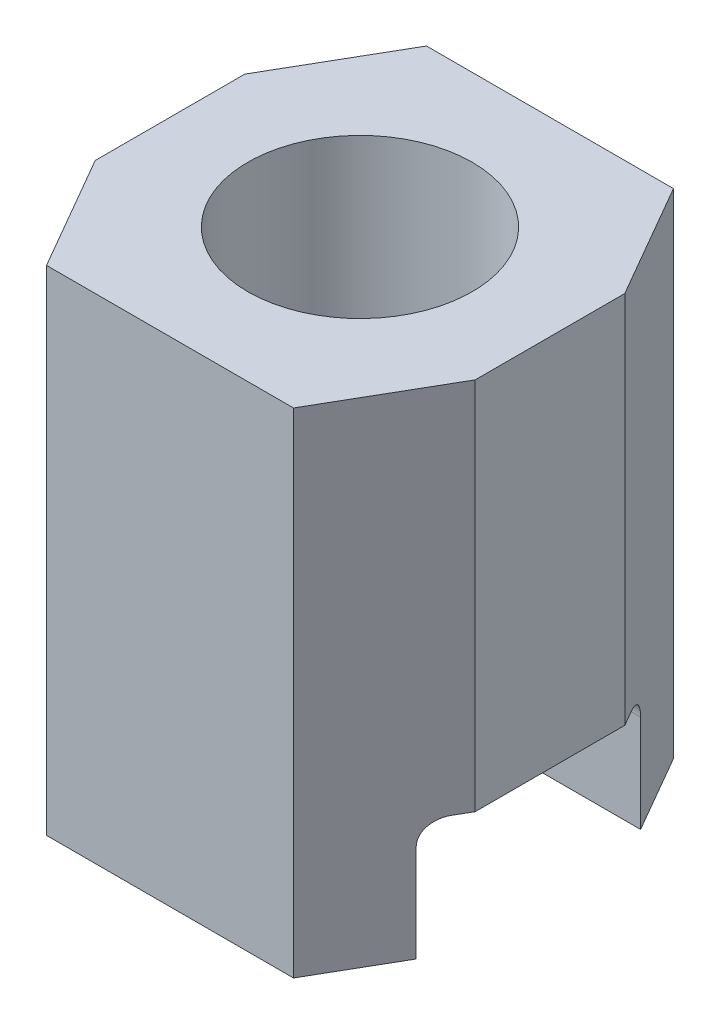
ISO-10303-21;
HEADER;
FILE_DESCRIPTION(('STEP AP214'),'2;1');
FILE_NAME('part.step','',(''),(''),'','','');
FILE_SCHEMA(('AUTOMOTIVE_DESIGN { 1 0 10303 214 1 1 1 1 }'));
ENDSEC;
DATA;
#1=APPLICATION_CONTEXT('core data for automotive mechanical design processes');
#2=APPLICATION_PROTOCOL_DEFINITION('international standard','automotive_design',2000,#1);
#3=PRODUCT_CONTEXT('',#1,'mechanical');
#4=PRODUCT('Part','Part','',(#3));
#5=PRODUCT_RELATED_PRODUCT_CATEGORY('part','',(#4));
#6=PRODUCT_DEFINITION_FORMATION('','',#4);
#7=PRODUCT_DEFINITION_CONTEXT('part definition',#1,'design');
#8=PRODUCT_DEFINITION('design','',#6,#7);
#9=PRODUCT_DEFINITION_SHAPE('','',#8);
#10=(LENGTH_UNIT() NAMED_UNIT(*) SI_UNIT(.MILLI.,.METRE.));
#11=(NAMED_UNIT(*) PLANE_ANGLE_UNIT() SI_UNIT($,.RADIAN.));
#12=(NAMED_UNIT(*) SI_UNIT($,.STERADIAN.) SOLID_ANGLE_UNIT());
#13=UNCERTAINTY_MEASURE_WITH_UNIT(LENGTH_MEASURE(1.E-05),#10,'distance_accuracy_value','');
#14=(GEOMETRIC_REPRESENTATION_CONTEXT(3) GLOBAL_UNCERTAINTY_ASSIGNED_CONTEXT((#13)) GLOBAL_UNIT_ASSIGNED_CONTEXT((#10,
#11,#12)) REPRESENTATION_CONTEXT('',''));
#15=CARTESIAN_POINT('',(0.,0.,0.));
#16=DIRECTION('',(0.,0.,1.));
#17=DIRECTION('',(1.,0.,0.));
#18=AXIS2_PLACEMENT_3D('',#15,#16,#17);
#19=CARTESIAN_POINT('',(0.,3.3,0.));
#20=DIRECTION('',(0.,-1.,0.));
#21=DIRECTION('',(0.,0.,-1.));
#22=AXIS2_PLACEMENT_3D('',#19,#20,#21);
#23=CYLINDRICAL_SURFACE('',#22,0.675);
#24=CARTESIAN_POINT('',(-0.309232921921328,0.8,-0.599999999999999));
#25=CARTESIAN_POINT('',(-0.293758565389485,0.799987558335421,-0.607974719059376));
#26=CARTESIAN_POINT('',(-0.278007555192805,0.799367106120461,-0.6153353967344));
#27=CARTESIAN_POINT('',(-0.24604250612503,0.797368657127726,-0.628799456506238));
#28=CARTESIAN_POINT('',(-0.229829051483721,0.795991579256473,-0.634904351389737));
#29=CARTESIAN_POINT('',(-0.180656010382408,0.791416118461383,-0.651290683062896));
#30=CARTESIAN_POINT('',(-0.147084684163077,0.787768815515238,-0.659684327113981));
#31=CARTESIAN_POINT('',(-0.0952185563023754,0.783488583059046,-0.668494789506155));
#32=CARTESIAN_POINT('',(-0.0772740178003726,0.782247628946401,-0.670806758580366));
#33=CARTESIAN_POINT('',(-0.0412245284595988,0.780499542711605,-0.673982479585743));
#34=CARTESIAN_POINT('',(-0.0231196776247754,0.779991981640827,-0.674847078105324));
#35=CARTESIAN_POINT('',(0.0131083447096233,0.779837068245208,-0.675115800353034));
#36=CARTESIAN_POINT('',(0.0312315190272777,0.780189878682696,-0.674519647740835));
#37=CARTESIAN_POINT('',(0.0673378419471818,0.781665054969914,-0.671877055072463));
#38=CARTESIAN_POINT('',(0.085320947870717,0.782787646755871,-0.669830189215849));
#39=CARTESIAN_POINT('',(0.138950825568206,0.786943014713233,-0.661533601460079));
#40=CARTESIAN_POINT('',(0.174228798175258,0.790762474303631,-0.653127610667915));
#41=CARTESIAN_POINT('',(0.225877955633943,0.795645534336564,-0.636344312659647));
#42=CARTESIAN_POINT('',(0.242912566135772,0.797134112618575,-0.630039021519494));
#43=CARTESIAN_POINT('',(0.276476574402827,0.799304597594941,-0.616048824535539));
#44=CARTESIAN_POINT('',(0.293005389520438,0.799985605747464,-0.608362392892528));
#45=CARTESIAN_POINT('',(0.309232921921326,0.800000000000028,-0.600000000000001));
#46=B_SPLINE_CURVE_WITH_KNOTS('',3,(#24,#25,#26,#27,#28,#29,#30,#31,#32,#33,#34,#35,#36,#37,#38,
#39,#40,#41,#42,#43,#44,#45),.UNSPECIFIED.,.F.,.F.,(4,2,2,2,2,2,2,2,2,2,4),(0.,
0.0521470728682404,0.104230953713443,0.208134724628482,0.262484368425788,0.31680221119194,
0.371130330430986,0.425474402183298,0.53430871682001,0.588922922230222,0.643597837217738),.UNSPECIFIED.);
#47=CARTESIAN_POINT('',(-0.309232921921328,0.8,-0.599999999999999));
#48=VERTEX_POINT('',#47);
#49=CARTESIAN_POINT('',(0.309232921921327,0.8,-0.599999999999999));
#50=VERTEX_POINT('',#49);
#51=EDGE_CURVE('E294',#48,#50,#46,.T.);
#52=ORIENTED_EDGE('',*,*,#51,.T.);
#53=CARTESIAN_POINT('',(0.,0.8,0.));
#54=DIRECTION('',(0.,1.,0.));
#55=DIRECTION('',(0.,0.,1.));
#56=AXIS2_PLACEMENT_3D('',#53,#54,#55);
#57=CIRCLE('',#56,0.675);
#58=CARTESIAN_POINT('',(0.309232921921327,0.8,0.599999999999999));
#59=VERTEX_POINT('',#58);
#60=EDGE_CURVE('E280',#50,#59,#57,.F.);
#61=ORIENTED_EDGE('',*,*,#60,.T.);
#62=CARTESIAN_POINT('',(0.309232921921327,0.8,0.599999999999999));
#63=CARTESIAN_POINT('',(0.293758565389485,0.799987558335421,0.607974719059377));
#64=CARTESIAN_POINT('',(0.278007555192805,0.799367106120461,0.6153353967344));
#65=CARTESIAN_POINT('',(0.246042506125029,0.797368657127726,0.628799456506239));
#66=CARTESIAN_POINT('',(0.22982905148372,0.795991579256473,0.634904351389737));
#67=CARTESIAN_POINT('',(0.180656010382407,0.791416118461383,0.651290683062897));
#68=CARTESIAN_POINT('',(0.147084684163076,0.787768815515237,0.659684327113981));
#69=CARTESIAN_POINT('',(0.0952185563023738,0.783488583059046,0.668494789506155));
#70=CARTESIAN_POINT('',(0.0772740178003709,0.782247628946401,0.670806758580366));
#71=CARTESIAN_POINT('',(0.0412245284595968,0.780499542711605,0.673982479585743));
#72=CARTESIAN_POINT('',(0.0231196776247733,0.779991981640827,0.674847078105324));
#73=CARTESIAN_POINT('',(-0.0131083447096256,0.779837068245208,0.675115800353034));
#74=CARTESIAN_POINT('',(-0.0312315190272802,0.780189878682696,0.674519647740835));
#75=CARTESIAN_POINT('',(-0.0673378419471845,0.781665054969915,0.671877055072463));
#76=CARTESIAN_POINT('',(-0.0853209478707198,0.782787646755871,0.669830189215848));
#77=CARTESIAN_POINT('',(-0.138950825568208,0.786943014713233,0.661533601460079));
#78=CARTESIAN_POINT('',(-0.17422879817526,0.790762474303631,0.653127610667915));
#79=CARTESIAN_POINT('',(-0.225877955633943,0.795645534336564,0.636344312659646));
#80=CARTESIAN_POINT('',(-0.242912566135772,0.797134112618575,0.630039021519494));
#81=CARTESIAN_POINT('',(-0.276476574402826,0.799304597594941,0.61604882453554));
#82=CARTESIAN_POINT('',(-0.293005389520437,0.799985605747464,0.608362392892528));
#83=CARTESIAN_POINT('',(-0.309232921921324,0.800000000000028,0.600000000000002));
#84=B_SPLINE_CURVE_WITH_KNOTS('',3,(#62,#63,#64,#65,#66,#67,#68,#69,#70,#71,#72,#73,#74,#75,#76,
#77,#78,#79,#80,#81,#82,#83),.UNSPECIFIED.,.F.,.F.,(4,2,2,2,2,2,2,2,2,2,4),(0.,
0.0521470728682406,0.104230953713444,0.208134724628483,0.262484368425789,0.316802211191941,
0.371130330430988,0.425474402183301,0.53430871682001,0.588922922230221,0.643597837217735),.UNSPECIFIED.);
#85=CARTESIAN_POINT('',(-0.309232921921327,0.8,0.599999999999999));
#86=VERTEX_POINT('',#85);
#87=EDGE_CURVE('E272',#59,#86,#84,.T.);
#88=ORIENTED_EDGE('',*,*,#87,.T.);
#89=EDGE_CURVE('E301',#86,#48,#57,.F.);
#90=ORIENTED_EDGE('',*,*,#89,.T.);
#91=EDGE_LOOP('',(#52,#61,#88,#90));
#92=FACE_BOUND('',#91,.T.);
#93=CARTESIAN_POINT('',(0.,1.3,0.));
#94=DIRECTION('',(0.,1.,0.));
#95=DIRECTION('',(0.,0.,1.));
#96=AXIS2_PLACEMENT_3D('',#93,#94,#95);
#97=CIRCLE('',#96,0.675);
#98=CARTESIAN_POINT('',(0.,1.3,0.675));
#99=VERTEX_POINT('',#98);
#100=EDGE_CURVE('E37',#99,#99,#97,.T.);
#101=ORIENTED_EDGE('',*,*,#100,.T.);
#102=EDGE_LOOP('',(#101));
#103=FACE_BOUND('',#102,.T.);
#104=ADVANCED_FACE('F33',(#92,#103),#23,.F.);
#105=CARTESIAN_POINT('',(0.,0.,0.));
#106=DIRECTION('',(0.,-1.,0.));
#107=DIRECTION('',(0.,0.,-1.));
#108=AXIS2_PLACEMENT_3D('',#105,#106,#107);
#109=PLANE('',#108);
#110=DIRECTION('',(-1.,0.,0.));
#111=VECTOR('',#110,1.);
#112=CARTESIAN_POINT('',(1.271,0.,-0.75));
#113=LINE('',#112,#111);
#114=CARTESIAN_POINT('',(1.12566243270259,0.,-0.75));
#115=VERTEX_POINT('',#114);
#116=CARTESIAN_POINT('',(-1.1256624327026,0.,-0.75));
#117=VERTEX_POINT('',#116);
#118=EDGE_CURVE('E159',#115,#117,#113,.T.);
#119=ORIENTED_EDGE('',*,*,#118,.T.);
#120=DIRECTION('',(-0.499999999999998,0.,0.86602540378444));
#121=VECTOR('',#120,1.);
#122=CARTESIAN_POINT('',(-1.27,0.,-0.5));
#123=LINE('',#122,#121);
#124=CARTESIAN_POINT('',(-0.825440292723991,0.,-1.27));
#125=VERTEX_POINT('',#124);
#126=EDGE_CURVE('E174',#125,#117,#123,.T.);
#127=ORIENTED_EDGE('',*,*,#126,.F.);
#128=DIRECTION('',(-1.,0.,0.));
#129=VECTOR('',#128,1.);
#130=CARTESIAN_POINT('',(-0.825440292723991,0.,-1.27));
#131=LINE('',#130,#129);
#132=CARTESIAN_POINT('',(0.825440292723991,0.,-1.27));
#133=VERTEX_POINT('',#132);
#134=EDGE_CURVE('E186',#133,#125,#131,.T.);
#135=ORIENTED_EDGE('',*,*,#134,.F.);
#136=DIRECTION('',(-0.499999999999997,0.,-0.86602540378444));
#137=VECTOR('',#136,1.);
#138=CARTESIAN_POINT('',(0.825440292723991,0.,-1.27));
#139=LINE('',#138,#137);
#140=EDGE_CURVE('E184',#115,#133,#139,.T.);
#141=ORIENTED_EDGE('',*,*,#140,.F.);
#142=EDGE_LOOP('',(#119,#127,#135,#141));
#143=FACE_BOUND('',#142,.T.);
#144=ADVANCED_FACE('F332',(#143),#109,.T.);
#145=CARTESIAN_POINT('',(0.,3.3,0.));
#146=DIRECTION('',(0.,-1.,0.));
#147=DIRECTION('',(0.,0.,-1.));
#148=AXIS2_PLACEMENT_3D('',#145,#146,#147);
#149=PLANE('',#148);
#150=CARTESIAN_POINT('',(0.,3.3,0.));
#151=DIRECTION('',(0.,1.,0.));
#152=DIRECTION('',(0.,0.,1.));
#153=AXIS2_PLACEMENT_3D('',#150,#151,#152);
#154=CIRCLE('',#153,0.75);
#155=CARTESIAN_POINT('',(0.,3.3,0.75));
#156=VERTEX_POINT('',#155);
#157=EDGE_CURVE('E485',#156,#156,#154,.T.);
#158=ORIENTED_EDGE('',*,*,#157,.F.);
#159=EDGE_LOOP('',(#158));
#160=FACE_BOUND('',#159,.T.);
#161=DIRECTION('',(-0.499999999999998,0.,0.86602540378444));
#162=VECTOR('',#161,1.);
#163=CARTESIAN_POINT('',(-1.27,3.3,-0.5));
#164=LINE('',#163,#162);
#165=CARTESIAN_POINT('',(-0.825440292723991,3.3,-1.27));
#166=VERTEX_POINT('',#165);
#167=CARTESIAN_POINT('',(-1.27,3.3,-0.5));
#168=VERTEX_POINT('',#167);
#169=EDGE_CURVE('E188',#166,#168,#164,.T.);
#170=ORIENTED_EDGE('',*,*,#169,.T.);
#171=DIRECTION('',(0.,0.,1.));
#172=VECTOR('',#171,1.);
#173=CARTESIAN_POINT('',(-1.27,3.3,0.5));
#174=LINE('',#173,#172);
#175=CARTESIAN_POINT('',(-1.27,3.3,0.5));
#176=VERTEX_POINT('',#175);
#177=EDGE_CURVE('E214',#168,#176,#174,.T.);
#178=ORIENTED_EDGE('',*,*,#177,.T.);
#179=DIRECTION('',(0.499999999999998,0.,0.86602540378444));
#180=VECTOR('',#179,1.);
#181=CARTESIAN_POINT('',(-0.825440292723991,3.3,1.27));
#182=LINE('',#181,#180);
#183=CARTESIAN_POINT('',(-0.825440292723991,3.3,1.27));
#184=VERTEX_POINT('',#183);
#185=EDGE_CURVE('E210',#176,#184,#182,.T.);
#186=ORIENTED_EDGE('',*,*,#185,.T.);
#187=DIRECTION('',(1.,0.,0.));
#188=VECTOR('',#187,1.);
#189=CARTESIAN_POINT('',(0.825440292723991,3.3,1.27));
#190=LINE('',#189,#188);
#191=CARTESIAN_POINT('',(0.825440292723991,3.3,1.27));
#192=VERTEX_POINT('',#191);
#193=EDGE_CURVE('E241',#184,#192,#190,.T.);
#194=ORIENTED_EDGE('',*,*,#193,.T.);
#195=DIRECTION('',(0.499999999999997,0.,-0.86602540378444));
#196=VECTOR('',#195,1.);
#197=CARTESIAN_POINT('',(1.27,3.3,0.5));
#198=LINE('',#197,#196);
#199=CARTESIAN_POINT('',(1.27,3.3,0.5));
#200=VERTEX_POINT('',#199);
#201=EDGE_CURVE('E243',#192,#200,#198,.T.);
#202=ORIENTED_EDGE('',*,*,#201,.T.);
#203=DIRECTION('',(0.,0.,-1.));
#204=VECTOR('',#203,1.);
#205=CARTESIAN_POINT('',(1.27,3.3,-0.5));
#206=LINE('',#205,#204);
#207=CARTESIAN_POINT('',(1.27,3.3,-0.5));
#208=VERTEX_POINT('',#207);
#209=EDGE_CURVE('E245',#200,#208,#206,.T.);
#210=ORIENTED_EDGE('',*,*,#209,.T.);
#211=DIRECTION('',(-0.499999999999997,0.,-0.86602540378444));
#212=VECTOR('',#211,1.);
#213=CARTESIAN_POINT('',(0.825440292723991,3.3,-1.27));
#214=LINE('',#213,#212);
#215=CARTESIAN_POINT('',(0.825440292723991,3.3,-1.27));
#216=VERTEX_POINT('',#215);
#217=EDGE_CURVE('E247',#208,#216,#214,.T.);
#218=ORIENTED_EDGE('',*,*,#217,.T.);
#219=DIRECTION('',(-1.,0.,0.));
#220=VECTOR('',#219,1.);
#221=CARTESIAN_POINT('',(-0.825440292723991,3.3,-1.27));
#222=LINE('',#221,#220);
#223=EDGE_CURVE('E193',#216,#166,#222,.T.);
#224=ORIENTED_EDGE('',*,*,#223,.T.);
#225=EDGE_LOOP('',(#170,#178,#186,#194,#202,#210,#218,#224));
#226=FACE_BOUND('',#225,.T.);
#227=ADVANCED_FACE('F251',(#160,#226),#149,.F.);
#228=DIRECTION('',(-1.,0.,0.));
#229=VECTOR('',#228,1.);
#230=CARTESIAN_POINT('',(1.271,0.,0.75));
#231=LINE('',#230,#229);
#232=CARTESIAN_POINT('',(1.12566243270259,0.,0.75));
#233=VERTEX_POINT('',#232);
#234=CARTESIAN_POINT('',(-1.12566243270259,0.,0.75));
#235=VERTEX_POINT('',#234);
#236=EDGE_CURVE('E147',#233,#235,#231,.T.);
#237=ORIENTED_EDGE('',*,*,#236,.F.);
#238=DIRECTION('',(0.499999999999997,0.,-0.86602540378444));
#239=VECTOR('',#238,1.);
#240=CARTESIAN_POINT('',(1.27,0.,0.5));
#241=LINE('',#240,#239);
#242=CARTESIAN_POINT('',(0.825440292723991,0.,1.27));
#243=VERTEX_POINT('',#242);
#244=EDGE_CURVE('E176',#243,#233,#241,.T.);
#245=ORIENTED_EDGE('',*,*,#244,.F.);
#246=DIRECTION('',(1.,0.,0.));
#247=VECTOR('',#246,1.);
#248=CARTESIAN_POINT('',(0.825440292723991,0.,1.27));
#249=LINE('',#248,#247);
#250=CARTESIAN_POINT('',(-0.825440292723991,0.,1.27));
#251=VERTEX_POINT('',#250);
#252=EDGE_CURVE('E173',#251,#243,#249,.T.);
#253=ORIENTED_EDGE('',*,*,#252,.F.);
#254=DIRECTION('',(0.499999999999998,0.,0.86602540378444));
#255=VECTOR('',#254,1.);
#256=CARTESIAN_POINT('',(-0.825440292723991,0.,1.27));
#257=LINE('',#256,#255);
#258=EDGE_CURVE('E166',#235,#251,#257,.T.);
#259=ORIENTED_EDGE('',*,*,#258,.F.);
#260=EDGE_LOOP('',(#237,#245,#253,#259));
#261=FACE_BOUND('',#260,.T.);
#262=ADVANCED_FACE('F172',(#261),#109,.T.);
#263=CARTESIAN_POINT('',(-1.27,3.3,-0.5));
#264=DIRECTION('',(0.86602540378444,0.,0.499999999999998));
#265=DIRECTION('',(0.499999999999998,0.,-0.86602540378444));
#266=AXIS2_PLACEMENT_3D('',#263,#264,#265);
#267=PLANE('',#266);
#268=ORIENTED_EDGE('',*,*,#126,.T.);
#269=DIRECTION('',(0.,-1.,0.));
#270=VECTOR('',#269,1.);
#271=CARTESIAN_POINT('',(-1.1256624327026,0.,-0.75));
#272=LINE('',#271,#270);
#273=CARTESIAN_POINT('',(-1.1256624327026,0.649999999999999,-0.75));
#274=VERTEX_POINT('',#273);
#275=EDGE_CURVE('E266',#274,#117,#272,.T.);
#276=ORIENTED_EDGE('',*,*,#275,.F.);
#277=CARTESIAN_POINT('',(-1.21226497308104,0.65,-0.6));
#278=DIRECTION('',(0.86602540378444,0.,0.499999999999998));
#279=DIRECTION('',(-0.499999999999998,0.,0.86602540378444));
#280=AXIS2_PLACEMENT_3D('',#277,#278,#279);
#281=ELLIPSE('',#280,0.173205080756887,0.15);
#282=CARTESIAN_POINT('',(-1.21226497308104,0.8,-0.599999999999999));
#283=VERTEX_POINT('',#282);
#284=EDGE_CURVE('E263',#283,#274,#281,.F.);
#285=ORIENTED_EDGE('',*,*,#284,.F.);
#286=DIRECTION('',(0.499999999999998,0.,-0.86602540378444));
#287=VECTOR('',#286,1.);
#288=CARTESIAN_POINT('',(-0.591448729810785,0.8,-1.67528527550813));
#289=LINE('',#288,#287);
#290=CARTESIAN_POINT('',(-1.27,0.8,-0.5));
#291=VERTEX_POINT('',#290);
#292=EDGE_CURVE('E261',#291,#283,#289,.T.);
#293=ORIENTED_EDGE('',*,*,#292,.F.);
#294=DIRECTION('',(0.,-1.,0.));
#295=VECTOR('',#294,1.);
#296=CARTESIAN_POINT('',(-1.27,3.3,-0.5));
#297=LINE('',#296,#295);
#298=EDGE_CURVE('E11',#168,#291,#297,.T.);
#299=ORIENTED_EDGE('',*,*,#298,.F.);
#300=ORIENTED_EDGE('',*,*,#169,.F.);
#301=DIRECTION('',(0.,-1.,0.));
#302=VECTOR('',#301,1.);
#303=CARTESIAN_POINT('',(-0.825440292723991,3.3,-1.27));
#304=LINE('',#303,#302);
#305=EDGE_CURVE('E189',#166,#125,#304,.T.);
#306=ORIENTED_EDGE('',*,*,#305,.T.);
#307=EDGE_LOOP('',(#268,#276,#285,#293,#299,#300,#306));
#308=FACE_BOUND('',#307,.T.);
#309=ADVANCED_FACE('F35',(#308),#267,.F.);
#310=CARTESIAN_POINT('',(-1.27,3.3,0.5));
#311=DIRECTION('',(1.,0.,0.));
#312=DIRECTION('',(0.,0.,-1.));
#313=AXIS2_PLACEMENT_3D('',#310,#311,#312);
#314=PLANE('',#313);
#315=ORIENTED_EDGE('',*,*,#298,.T.);
#316=DIRECTION('',(0.,0.,-1.));
#317=VECTOR('',#316,1.);
#318=CARTESIAN_POINT('',(-1.27,0.8,-0.599999999999999));
#319=LINE('',#318,#317);
#320=CARTESIAN_POINT('',(-1.27,0.8,0.5));
#321=VERTEX_POINT('',#320);
#322=EDGE_CURVE('E216',#321,#291,#319,.T.);
#323=ORIENTED_EDGE('',*,*,#322,.F.);
#324=DIRECTION('',(0.,-1.,0.));
#325=VECTOR('',#324,1.);
#326=CARTESIAN_POINT('',(-1.27,3.3,0.5));
#327=LINE('',#326,#325);
#328=EDGE_CURVE('E42',#176,#321,#327,.T.);
#329=ORIENTED_EDGE('',*,*,#328,.F.);
#330=ORIENTED_EDGE('',*,*,#177,.F.);
#331=EDGE_LOOP('',(#315,#323,#329,#330));
#332=FACE_BOUND('',#331,.T.);
#333=ADVANCED_FACE('F213',(#332),#314,.F.);
#334=CARTESIAN_POINT('',(-0.825440292723991,3.3,1.27));
#335=DIRECTION('',(0.86602540378444,0.,-0.499999999999998));
#336=DIRECTION('',(-0.499999999999998,0.,-0.86602540378444));
#337=AXIS2_PLACEMENT_3D('',#334,#335,#336);
#338=PLANE('',#337);
#339=ORIENTED_EDGE('',*,*,#328,.T.);
#340=DIRECTION('',(-0.499999999999998,0.,-0.86602540378444));
#341=VECTOR('',#340,1.);
#342=CARTESIAN_POINT('',(-1.11106397208145,0.8,0.775285275508125));
#343=LINE('',#342,#341);
#344=CARTESIAN_POINT('',(-1.21226497308104,0.8,0.599999999999999));
#345=VERTEX_POINT('',#344);
#346=EDGE_CURVE('E209',#345,#321,#343,.T.);
#347=ORIENTED_EDGE('',*,*,#346,.F.);
#348=CARTESIAN_POINT('',(-1.21226497308104,0.65,0.6));
#349=DIRECTION('',(0.86602540378444,0.,-0.499999999999998));
#350=DIRECTION('',(-0.499999999999998,0.,-0.86602540378444));
#351=AXIS2_PLACEMENT_3D('',#348,#349,#350);
#352=ELLIPSE('',#351,0.173205080756887,0.15);
#353=CARTESIAN_POINT('',(-1.12566243270259,0.649999999999999,0.75));
#354=VERTEX_POINT('',#353);
#355=EDGE_CURVE('E169',#354,#345,#352,.F.);
#356=ORIENTED_EDGE('',*,*,#355,.F.);
#357=DIRECTION('',(0.,1.,0.));
#358=VECTOR('',#357,1.);
#359=CARTESIAN_POINT('',(-1.12566243270259,0.,0.75));
#360=LINE('',#359,#358);
#361=EDGE_CURVE('E150',#235,#354,#360,.T.);
#362=ORIENTED_EDGE('',*,*,#361,.F.);
#363=ORIENTED_EDGE('',*,*,#258,.T.);
#364=DIRECTION('',(0.,-1.,0.));
#365=VECTOR('',#364,1.);
#366=CARTESIAN_POINT('',(-0.825440292723991,3.3,1.27));
#367=LINE('',#366,#365);
#368=EDGE_CURVE('E205',#184,#251,#367,.T.);
#369=ORIENTED_EDGE('',*,*,#368,.F.);
#370=ORIENTED_EDGE('',*,*,#185,.F.);
#371=EDGE_LOOP('',(#339,#347,#356,#362,#363,#369,#370));
#372=FACE_BOUND('',#371,.T.);
#373=ADVANCED_FACE('F164',(#372),#338,.F.);
#374=CARTESIAN_POINT('',(0.825440292723991,3.3,1.27));
#375=DIRECTION('',(0.,0.,-1.));
#376=DIRECTION('',(-1.,0.,0.));
#377=AXIS2_PLACEMENT_3D('',#374,#375,#376);
#378=PLANE('',#377);
#379=ORIENTED_EDGE('',*,*,#252,.T.);
#380=DIRECTION('',(0.,-1.,0.));
#381=VECTOR('',#380,1.);
#382=CARTESIAN_POINT('',(0.825440292723991,3.3,1.27));
#383=LINE('',#382,#381);
#384=EDGE_CURVE('E202',#192,#243,#383,.T.);
#385=ORIENTED_EDGE('',*,*,#384,.F.);
#386=ORIENTED_EDGE('',*,*,#193,.F.);
#387=ORIENTED_EDGE('',*,*,#368,.T.);
#388=EDGE_LOOP('',(#379,#385,#386,#387));
#389=FACE_BOUND('',#388,.T.);
#390=ADVANCED_FACE('F320',(#389),#378,.F.);
#391=CARTESIAN_POINT('',(1.27,3.3,0.5));
#392=DIRECTION('',(-0.86602540378444,0.,-0.499999999999997));
#393=DIRECTION('',(-0.499999999999997,0.,0.86602540378444));
#394=AXIS2_PLACEMENT_3D('',#391,#392,#393);
#395=PLANE('',#394);
#396=CARTESIAN_POINT('',(1.21226497308104,0.65,0.6));
#397=DIRECTION('',(-0.86602540378444,0.,-0.499999999999997));
#398=DIRECTION('',(-0.499999999999997,0.,0.86602540378444));
#399=AXIS2_PLACEMENT_3D('',#396,#397,#398);
#400=ELLIPSE('',#399,0.173205080756887,0.15);
#401=CARTESIAN_POINT('',(1.21226497308104,0.8,0.599999999999999));
#402=VERTEX_POINT('',#401);
#403=CARTESIAN_POINT('',(1.12566243270259,0.649999999999999,0.75));
#404=VERTEX_POINT('',#403);
#405=EDGE_CURVE('E225',#402,#404,#400,.F.);
#406=ORIENTED_EDGE('',*,*,#405,.F.);
#407=DIRECTION('',(-0.499999999999997,0.,0.86602540378444));
#408=VECTOR('',#407,1.);
#409=CARTESIAN_POINT('',(1.74656397208144,0.8,-0.325433012701895));
#410=LINE('',#409,#408);
#411=CARTESIAN_POINT('',(1.27,0.8,0.5));
#412=VERTEX_POINT('',#411);
#413=EDGE_CURVE('E220',#412,#402,#410,.T.);
#414=ORIENTED_EDGE('',*,*,#413,.F.);
#415=DIRECTION('',(0.,-1.,0.));
#416=VECTOR('',#415,1.);
#417=CARTESIAN_POINT('',(1.27,3.3,0.5));
#418=LINE('',#417,#416);
#419=EDGE_CURVE('E199',#200,#412,#418,.T.);
#420=ORIENTED_EDGE('',*,*,#419,.F.);
#421=ORIENTED_EDGE('',*,*,#201,.F.);
#422=ORIENTED_EDGE('',*,*,#384,.T.);
#423=ORIENTED_EDGE('',*,*,#244,.T.);
#424=DIRECTION('',(0.,-1.,0.));
#425=VECTOR('',#424,1.);
#426=CARTESIAN_POINT('',(1.12566243270259,0.,0.75));
#427=LINE('',#426,#425);
#428=EDGE_CURVE('E153',#404,#233,#427,.T.);
#429=ORIENTED_EDGE('',*,*,#428,.F.);
#430=EDGE_LOOP('',(#406,#414,#420,#421,#422,#423,#429));
#431=FACE_BOUND('',#430,.T.);
#432=ADVANCED_FACE('F314',(#431),#395,.F.);
#433=CARTESIAN_POINT('',(1.27,3.3,-0.5));
#434=DIRECTION('',(-1.,0.,0.));
#435=DIRECTION('',(0.,0.,1.));
#436=AXIS2_PLACEMENT_3D('',#433,#434,#435);
#437=PLANE('',#436);
#438=ORIENTED_EDGE('',*,*,#419,.T.);
#439=DIRECTION('',(0.,0.,1.));
#440=VECTOR('',#439,1.);
#441=CARTESIAN_POINT('',(1.27,0.8,-0.599999999999999));
#442=LINE('',#441,#440);
#443=CARTESIAN_POINT('',(1.27,0.8,-0.5));
#444=VERTEX_POINT('',#443);
#445=EDGE_CURVE('E307',#444,#412,#442,.T.);
#446=ORIENTED_EDGE('',*,*,#445,.F.);
#447=DIRECTION('',(0.,-1.,0.));
#448=VECTOR('',#447,1.);
#449=CARTESIAN_POINT('',(1.27,3.3,-0.5));
#450=LINE('',#449,#448);
#451=EDGE_CURVE('E196',#208,#444,#450,.T.);
#452=ORIENTED_EDGE('',*,*,#451,.F.);
#453=ORIENTED_EDGE('',*,*,#209,.F.);
#454=EDGE_LOOP('',(#438,#446,#452,#453));
#455=FACE_BOUND('',#454,.T.);
#456=ADVANCED_FACE('F325',(#455),#437,.F.);
#457=CARTESIAN_POINT('',(0.825440292723991,3.3,-1.27));
#458=DIRECTION('',(-0.86602540378444,0.,0.499999999999997));
#459=DIRECTION('',(0.499999999999997,0.,0.86602540378444));
#460=AXIS2_PLACEMENT_3D('',#457,#458,#459);
#461=PLANE('',#460);
#462=CARTESIAN_POINT('',(1.21226497308104,0.65,-0.6));
#463=DIRECTION('',(-0.86602540378444,0.,0.499999999999997));
#464=DIRECTION('',(-0.499999999999997,0.,-0.86602540378444));
#465=AXIS2_PLACEMENT_3D('',#462,#463,#464);
#466=ELLIPSE('',#465,0.173205080756887,0.15);
#467=CARTESIAN_POINT('',(1.12566243270259,0.649999999999999,-0.75));
#468=VERTEX_POINT('',#467);
#469=CARTESIAN_POINT('',(1.21226497308104,0.8,-0.599999999999999));
#470=VERTEX_POINT('',#469);
#471=EDGE_CURVE('E49',#468,#470,#466,.F.);
#472=ORIENTED_EDGE('',*,*,#471,.F.);
#473=DIRECTION('',(0.,1.,0.));
#474=VECTOR('',#473,1.);
#475=CARTESIAN_POINT('',(1.12566243270259,0.,-0.75));
#476=LINE('',#475,#474);
#477=EDGE_CURVE('E304',#115,#468,#476,.T.);
#478=ORIENTED_EDGE('',*,*,#477,.F.);
#479=ORIENTED_EDGE('',*,*,#140,.T.);
#480=DIRECTION('',(0.,-1.,0.));
#481=VECTOR('',#480,1.);
#482=CARTESIAN_POINT('',(0.825440292723991,3.3,-1.27));
#483=LINE('',#482,#481);
#484=EDGE_CURVE('E192',#216,#133,#483,.T.);
#485=ORIENTED_EDGE('',*,*,#484,.F.);
#486=ORIENTED_EDGE('',*,*,#217,.F.);
#487=ORIENTED_EDGE('',*,*,#451,.T.);
#488=DIRECTION('',(0.499999999999997,0.,0.86602540378444));
#489=VECTOR('',#488,1.);
#490=CARTESIAN_POINT('',(1.22694872981078,0.8,-0.574566987298107));
#491=LINE('',#490,#489);
#492=EDGE_CURVE('E300',#470,#444,#491,.T.);
#493=ORIENTED_EDGE('',*,*,#492,.F.);
#494=EDGE_LOOP('',(#472,#478,#479,#485,#486,#487,#493));
#495=FACE_BOUND('',#494,.T.);
#496=ADVANCED_FACE('F328',(#495),#461,.F.);
#497=CARTESIAN_POINT('',(-0.825440292723991,3.3,-1.27));
#498=DIRECTION('',(0.,0.,1.));
#499=DIRECTION('',(1.,0.,0.));
#500=AXIS2_PLACEMENT_3D('',#497,#498,#499);
#501=PLANE('',#500);
#502=ORIENTED_EDGE('',*,*,#134,.T.);
#503=ORIENTED_EDGE('',*,*,#305,.F.);
#504=ORIENTED_EDGE('',*,*,#223,.F.);
#505=ORIENTED_EDGE('',*,*,#484,.T.);
#506=EDGE_LOOP('',(#502,#503,#504,#505));
#507=FACE_BOUND('',#506,.T.);
#508=ADVANCED_FACE('F256',(#507),#501,.F.);
#509=CARTESIAN_POINT('',(1.271,0.,-0.75));
#510=DIRECTION('',(0.,0.,-1.));
#511=DIRECTION('',(-1.,0.,0.));
#512=AXIS2_PLACEMENT_3D('',#509,#510,#511);
#513=PLANE('',#512);
#514=ORIENTED_EDGE('',*,*,#275,.T.);
#515=ORIENTED_EDGE('',*,*,#118,.F.);
#516=ORIENTED_EDGE('',*,*,#477,.T.);
#517=DIRECTION('',(-1.,0.,0.));
#518=VECTOR('',#517,1.);
#519=CARTESIAN_POINT('',(1.271,0.649999999999999,-0.75));
#520=LINE('',#519,#518);
#521=EDGE_CURVE('E179',#468,#274,#520,.T.);
#522=ORIENTED_EDGE('',*,*,#521,.T.);
#523=EDGE_LOOP('',(#514,#515,#516,#522));
#524=FACE_BOUND('',#523,.T.);
#525=ADVANCED_FACE('F334',(#524),#513,.F.);
#526=CARTESIAN_POINT('',(1.271,0.65,-0.6));
#527=DIRECTION('',(-1.,0.,0.));
#528=DIRECTION('',(0.,0.,1.));
#529=AXIS2_PLACEMENT_3D('',#526,#527,#528);
#530=CYLINDRICAL_SURFACE('',#529,0.15);
#531=ORIENTED_EDGE('',*,*,#284,.T.);
#532=ORIENTED_EDGE('',*,*,#521,.F.);
#533=ORIENTED_EDGE('',*,*,#471,.T.);
#534=DIRECTION('',(-1.,0.,0.));
#535=VECTOR('',#534,1.);
#536=CARTESIAN_POINT('',(1.271,0.8,-0.599999999999999));
#537=LINE('',#536,#535);
#538=EDGE_CURVE('E231',#470,#50,#537,.T.);
#539=ORIENTED_EDGE('',*,*,#538,.T.);
#540=ORIENTED_EDGE('',*,*,#51,.F.);
#541=EDGE_CURVE('E232',#48,#283,#537,.T.);
#542=ORIENTED_EDGE('',*,*,#541,.T.);
#543=EDGE_LOOP('',(#531,#532,#533,#539,#540,#542));
#544=FACE_BOUND('',#543,.T.);
#545=ADVANCED_FACE('F291',(#544),#530,.F.);
#546=CARTESIAN_POINT('',(1.271,0.8,-0.599999999999999));
#547=DIRECTION('',(0.,1.,0.));
#548=DIRECTION('',(0.,0.,1.));
#549=AXIS2_PLACEMENT_3D('',#546,#547,#548);
#550=PLANE('',#549);
#551=ORIENTED_EDGE('',*,*,#292,.T.);
#552=ORIENTED_EDGE('',*,*,#541,.F.);
#553=ORIENTED_EDGE('',*,*,#89,.F.);
#554=DIRECTION('',(-1.,0.,0.));
#555=VECTOR('',#554,1.);
#556=CARTESIAN_POINT('',(1.271,0.8,0.599999999999999));
#557=LINE('',#556,#555);
#558=EDGE_CURVE('E57',#86,#345,#557,.T.);
#559=ORIENTED_EDGE('',*,*,#558,.T.);
#560=ORIENTED_EDGE('',*,*,#346,.T.);
#561=ORIENTED_EDGE('',*,*,#322,.T.);
#562=EDGE_LOOP('',(#551,#552,#553,#559,#560,#561));
#563=FACE_BOUND('',#562,.T.);
#564=ADVANCED_FACE('F336',(#563),#550,.F.);
#565=ORIENTED_EDGE('',*,*,#413,.T.);
#566=EDGE_CURVE('E235',#402,#59,#557,.T.);
#567=ORIENTED_EDGE('',*,*,#566,.T.);
#568=ORIENTED_EDGE('',*,*,#60,.F.);
#569=ORIENTED_EDGE('',*,*,#538,.F.);
#570=ORIENTED_EDGE('',*,*,#492,.T.);
#571=ORIENTED_EDGE('',*,*,#445,.T.);
#572=EDGE_LOOP('',(#565,#567,#568,#569,#570,#571));
#573=FACE_BOUND('',#572,.T.);
#574=ADVANCED_FACE('F341',(#573),#550,.F.);
#575=CARTESIAN_POINT('',(1.271,0.65,0.6));
#576=DIRECTION('',(-1.,0.,0.));
#577=DIRECTION('',(0.,0.,1.));
#578=AXIS2_PLACEMENT_3D('',#575,#576,#577);
#579=CYLINDRICAL_SURFACE('',#578,0.15);
#580=ORIENTED_EDGE('',*,*,#355,.T.);
#581=ORIENTED_EDGE('',*,*,#558,.F.);
#582=ORIENTED_EDGE('',*,*,#87,.F.);
#583=ORIENTED_EDGE('',*,*,#566,.F.);
#584=ORIENTED_EDGE('',*,*,#405,.T.);
#585=DIRECTION('',(-1.,0.,0.));
#586=VECTOR('',#585,1.);
#587=CARTESIAN_POINT('',(1.271,0.649999999999999,0.75));
#588=LINE('',#587,#586);
#589=EDGE_CURVE('E158',#404,#354,#588,.T.);
#590=ORIENTED_EDGE('',*,*,#589,.T.);
#591=EDGE_LOOP('',(#580,#581,#582,#583,#584,#590));
#592=FACE_BOUND('',#591,.T.);
#593=ADVANCED_FACE('F282',(#592),#579,.F.);
#594=CARTESIAN_POINT('',(1.271,0.,0.75));
#595=DIRECTION('',(0.,0.,1.));
#596=DIRECTION('',(1.,0.,0.));
#597=AXIS2_PLACEMENT_3D('',#594,#595,#596);
#598=PLANE('',#597);
#599=ORIENTED_EDGE('',*,*,#361,.T.);
#600=ORIENTED_EDGE('',*,*,#589,.F.);
#601=ORIENTED_EDGE('',*,*,#428,.T.);
#602=ORIENTED_EDGE('',*,*,#236,.T.);
#603=EDGE_LOOP('',(#599,#600,#601,#602));
#604=FACE_BOUND('',#603,.T.);
#605=ADVANCED_FACE('F149',(#604),#598,.F.);
#606=CARTESIAN_POINT('',(0.,1.3,0.));
#607=DIRECTION('',(0.,1.,0.));
#608=DIRECTION('',(0.,0.,1.));
#609=AXIS2_PLACEMENT_3D('',#606,#607,#608);
#610=CYLINDRICAL_SURFACE('',#609,0.75);
#611=CARTESIAN_POINT('',(0.,1.3,0.));
#612=DIRECTION('',(0.,1.,0.));
#613=DIRECTION('',(0.,0.,1.));
#614=AXIS2_PLACEMENT_3D('',#611,#612,#613);
#615=CIRCLE('',#614,0.75);
#616=CARTESIAN_POINT('',(0.,1.3,0.75));
#617=VERTEX_POINT('',#616);
#618=EDGE_CURVE('E484',#617,#617,#615,.T.);
#619=ORIENTED_EDGE('',*,*,#618,.F.);
#620=EDGE_LOOP('',(#619));
#621=FACE_BOUND('',#620,.T.);
#622=ORIENTED_EDGE('',*,*,#157,.T.);
#623=EDGE_LOOP('',(#622));
#624=FACE_BOUND('',#623,.T.);
#625=ADVANCED_FACE('F289',(#621,#624),#610,.F.);
#626=CARTESIAN_POINT('',(0.,1.3,0.));
#627=DIRECTION('',(0.,1.,0.));
#628=DIRECTION('',(0.,0.,1.));
#629=AXIS2_PLACEMENT_3D('',#626,#627,#628);
#630=PLANE('',#629);
#631=ORIENTED_EDGE('',*,*,#100,.F.);
#632=EDGE_LOOP('',(#631));
#633=FACE_BOUND('',#632,.T.);
#634=ORIENTED_EDGE('',*,*,#618,.T.);
#635=EDGE_LOOP('',(#634));
#636=FACE_BOUND('',#635,.T.);
#637=ADVANCED_FACE('F468',(#633,#636),#630,.T.);
#638=CLOSED_SHELL('',(#104,#144,#227,#262,#309,#333,#373,#390,#432,#456,#496,#508,#525,#545,
#564,#574,#593,#605,#625,#637));
#639=MANIFOLD_SOLID_BREP('B2',#638);
#640=ADVANCED_BREP_SHAPE_REPRESENTATION('',(#18,#639),#14);
#641=SHAPE_DEFINITION_REPRESENTATION(#9,#640);
ENDSEC;
END-ISO-10303-21;
